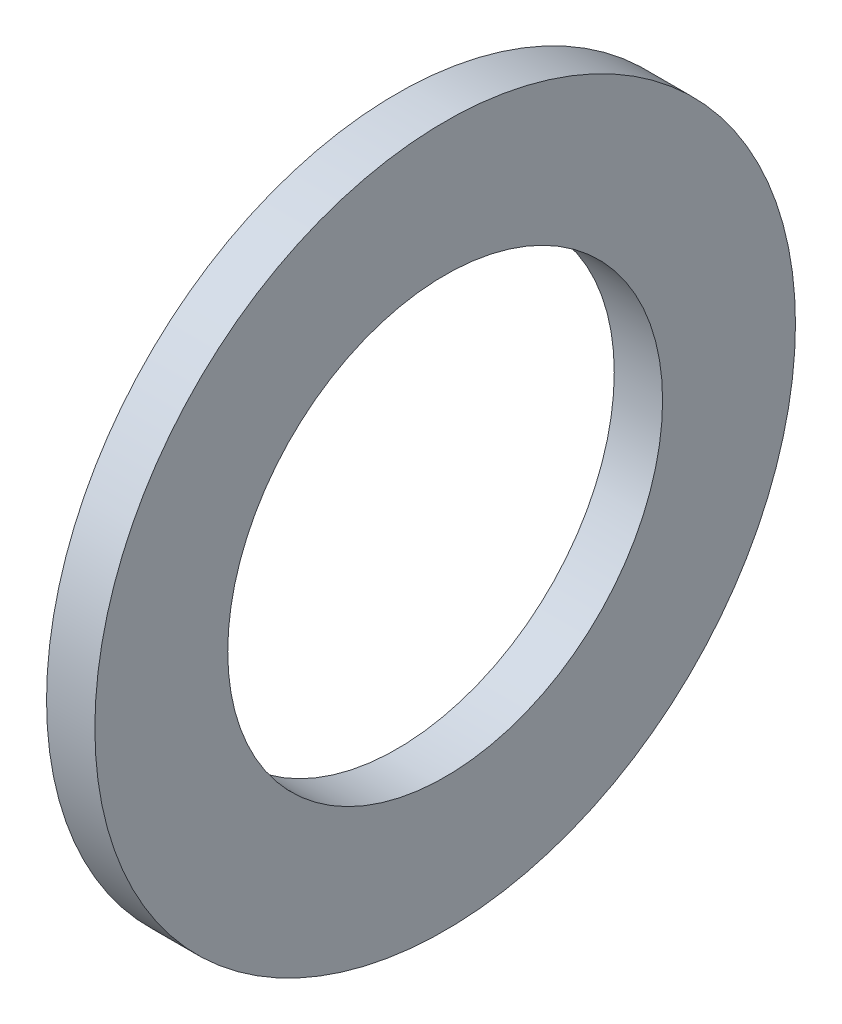
ISO-10303-21;
HEADER;
FILE_DESCRIPTION(('STEP AP214'),'2;1');
FILE_NAME('part.step','',(''),(''),'','','');
FILE_SCHEMA(('AUTOMOTIVE_DESIGN { 1 0 10303 214 1 1 1 1 }'));
ENDSEC;
DATA;
#1=APPLICATION_CONTEXT('core data for automotive mechanical design processes');
#2=APPLICATION_PROTOCOL_DEFINITION('international standard','automotive_design',2000,#1);
#3=PRODUCT_CONTEXT('',#1,'mechanical');
#4=PRODUCT('Part','Part','',(#3));
#5=PRODUCT_RELATED_PRODUCT_CATEGORY('part','',(#4));
#6=PRODUCT_DEFINITION_FORMATION('','',#4);
#7=PRODUCT_DEFINITION_CONTEXT('part definition',#1,'design');
#8=PRODUCT_DEFINITION('design','',#6,#7);
#9=PRODUCT_DEFINITION_SHAPE('','',#8);
#10=(LENGTH_UNIT() NAMED_UNIT(*) SI_UNIT(.MILLI.,.METRE.));
#11=(NAMED_UNIT(*) PLANE_ANGLE_UNIT() SI_UNIT($,.RADIAN.));
#12=(NAMED_UNIT(*) SI_UNIT($,.STERADIAN.) SOLID_ANGLE_UNIT());
#13=UNCERTAINTY_MEASURE_WITH_UNIT(LENGTH_MEASURE(1.E-05),#10,'distance_accuracy_value','');
#14=(GEOMETRIC_REPRESENTATION_CONTEXT(3) GLOBAL_UNCERTAINTY_ASSIGNED_CONTEXT((#13)) GLOBAL_UNIT_ASSIGNED_CONTEXT((#10,
#11,#12)) REPRESENTATION_CONTEXT('',''));
#15=CARTESIAN_POINT('',(0.,0.,0.));
#16=DIRECTION('',(0.,0.,1.));
#17=DIRECTION('',(1.,0.,0.));
#18=AXIS2_PLACEMENT_3D('',#15,#16,#17);
#19=CARTESIAN_POINT('',(-4.,0.,18.));
#20=DIRECTION('',(-1.,0.,0.));
#21=DIRECTION('',(0.,0.,1.));
#22=AXIS2_PLACEMENT_3D('',#19,#20,#21);
#23=PLANE('',#22);
#24=CARTESIAN_POINT('',(-3.99999999999999,0.,0.));
#25=DIRECTION('',(-1.,0.,0.));
#26=DIRECTION('',(0.,0.,1.));
#27=AXIS2_PLACEMENT_3D('',#24,#25,#26);
#28=CIRCLE('',#27,29.);
#29=CARTESIAN_POINT('',(-3.99999999999999,0.,29.));
#30=VERTEX_POINT('',#29);
#31=EDGE_CURVE('E53',#30,#30,#28,.T.);
#32=ORIENTED_EDGE('',*,*,#31,.T.);
#33=EDGE_LOOP('',(#32));
#34=FACE_BOUND('',#33,.T.);
#35=CARTESIAN_POINT('',(-4.,0.,0.));
#36=DIRECTION('',(-1.,0.,0.));
#37=DIRECTION('',(0.,0.,1.));
#38=AXIS2_PLACEMENT_3D('',#35,#36,#37);
#39=CIRCLE('',#38,18.);
#40=CARTESIAN_POINT('',(-4.,0.,18.));
#41=VERTEX_POINT('',#40);
#42=EDGE_CURVE('E10',#41,#41,#39,.T.);
#43=ORIENTED_EDGE('',*,*,#42,.F.);
#44=EDGE_LOOP('',(#43));
#45=FACE_BOUND('',#44,.T.);
#46=ADVANCED_FACE('F34',(#34,#45),#23,.T.);
#47=CARTESIAN_POINT('',(-89.8648648648649,0.,0.));
#48=DIRECTION('',(-1.,0.,0.));
#49=DIRECTION('',(0.,0.,1.));
#50=AXIS2_PLACEMENT_3D('',#47,#48,#49);
#51=CYLINDRICAL_SURFACE('',#50,18.);
#52=ORIENTED_EDGE('',*,*,#42,.T.);
#53=EDGE_LOOP('',(#52));
#54=FACE_BOUND('',#53,.T.);
#55=CARTESIAN_POINT('',(0.,0.,0.));
#56=DIRECTION('',(-1.,0.,0.));
#57=DIRECTION('',(0.,0.,1.));
#58=AXIS2_PLACEMENT_3D('',#55,#56,#57);
#59=CIRCLE('',#58,18.);
#60=CARTESIAN_POINT('',(0.,0.,18.));
#61=VERTEX_POINT('',#60);
#62=EDGE_CURVE('E41',#61,#61,#59,.T.);
#63=ORIENTED_EDGE('',*,*,#62,.F.);
#64=EDGE_LOOP('',(#63));
#65=FACE_BOUND('',#64,.T.);
#66=ADVANCED_FACE('F71',(#54,#65),#51,.F.);
#67=CARTESIAN_POINT('',(0.,0.,18.));
#68=DIRECTION('',(1.,0.,0.));
#69=DIRECTION('',(0.,0.,-1.));
#70=AXIS2_PLACEMENT_3D('',#67,#68,#69);
#71=PLANE('',#70);
#72=ORIENTED_EDGE('',*,*,#62,.T.);
#73=EDGE_LOOP('',(#72));
#74=FACE_BOUND('',#73,.T.);
#75=CARTESIAN_POINT('',(0.,0.,0.));
#76=DIRECTION('',(-1.,0.,0.));
#77=DIRECTION('',(0.,0.,1.));
#78=AXIS2_PLACEMENT_3D('',#75,#76,#77);
#79=CIRCLE('',#78,29.);
#80=CARTESIAN_POINT('',(0.,0.,29.));
#81=VERTEX_POINT('',#80);
#82=EDGE_CURVE('E47',#81,#81,#79,.T.);
#83=ORIENTED_EDGE('',*,*,#82,.F.);
#84=EDGE_LOOP('',(#83));
#85=FACE_BOUND('',#84,.T.);
#86=ADVANCED_FACE('F65',(#74,#85),#71,.T.);
#87=CARTESIAN_POINT('',(-89.8648648648649,0.,0.));
#88=DIRECTION('',(-1.,0.,0.));
#89=DIRECTION('',(0.,0.,1.));
#90=AXIS2_PLACEMENT_3D('',#87,#88,#89);
#91=CYLINDRICAL_SURFACE('',#90,29.);
#92=ORIENTED_EDGE('',*,*,#82,.T.);
#93=EDGE_LOOP('',(#92));
#94=FACE_BOUND('',#93,.T.);
#95=ORIENTED_EDGE('',*,*,#31,.F.);
#96=EDGE_LOOP('',(#95));
#97=FACE_BOUND('',#96,.T.);
#98=ADVANCED_FACE('F63',(#94,#97),#91,.T.);
#99=CLOSED_SHELL('',(#46,#66,#86,#98));
#100=MANIFOLD_SOLID_BREP('B2',#99);
#101=ADVANCED_BREP_SHAPE_REPRESENTATION('',(#18,#100),#14);
#102=SHAPE_DEFINITION_REPRESENTATION(#9,#101);
ENDSEC;
END-ISO-10303-21;
